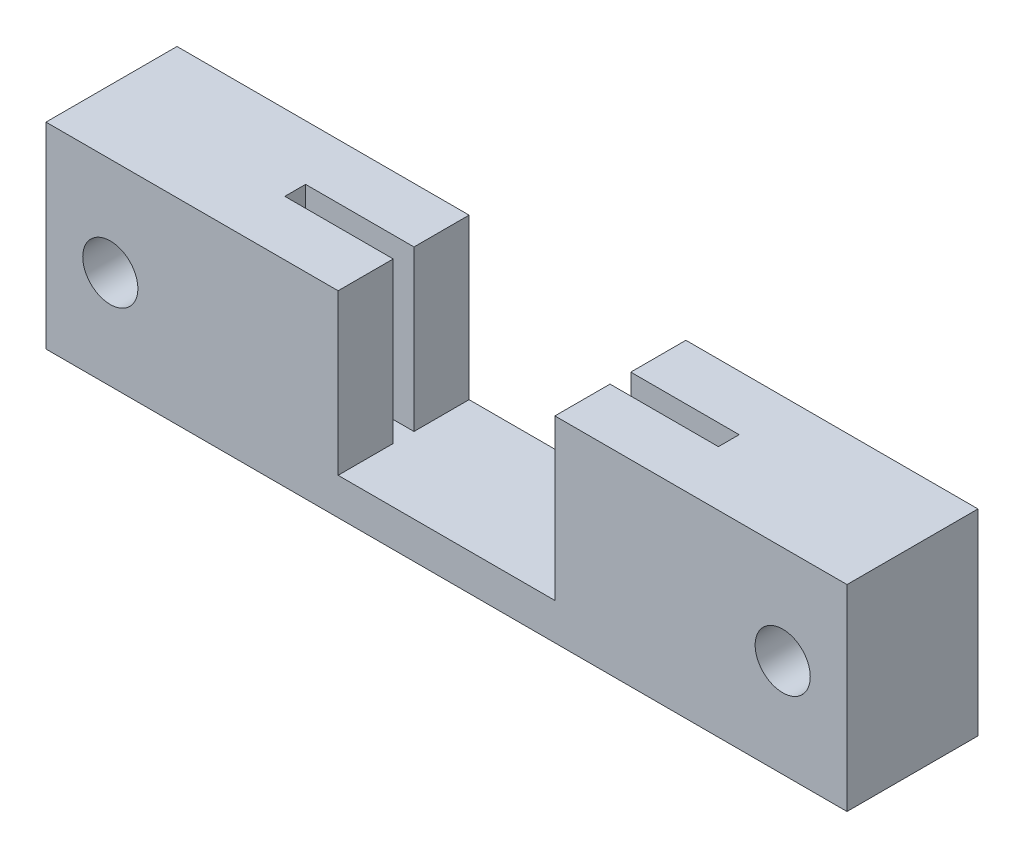
ISO-10303-21;
HEADER;
FILE_DESCRIPTION(('STEP AP214'),'2;1');
FILE_NAME('part.step','',(''),(''),'','','');
FILE_SCHEMA(('AUTOMOTIVE_DESIGN { 1 0 10303 214 1 1 1 1 }'));
ENDSEC;
DATA;
#1=APPLICATION_CONTEXT('core data for automotive mechanical design processes');
#2=APPLICATION_PROTOCOL_DEFINITION('international standard','automotive_design',2000,#1);
#3=PRODUCT_CONTEXT('',#1,'mechanical');
#4=PRODUCT('Part','Part','',(#3));
#5=PRODUCT_RELATED_PRODUCT_CATEGORY('part','',(#4));
#6=PRODUCT_DEFINITION_FORMATION('','',#4);
#7=PRODUCT_DEFINITION_CONTEXT('part definition',#1,'design');
#8=PRODUCT_DEFINITION('design','',#6,#7);
#9=PRODUCT_DEFINITION_SHAPE('','',#8);
#10=(LENGTH_UNIT() NAMED_UNIT(*) SI_UNIT(.MILLI.,.METRE.));
#11=(NAMED_UNIT(*) PLANE_ANGLE_UNIT() SI_UNIT($,.RADIAN.));
#12=(NAMED_UNIT(*) SI_UNIT($,.STERADIAN.) SOLID_ANGLE_UNIT());
#13=UNCERTAINTY_MEASURE_WITH_UNIT(LENGTH_MEASURE(1.E-05),#10,'distance_accuracy_value','');
#14=(GEOMETRIC_REPRESENTATION_CONTEXT(3) GLOBAL_UNCERTAINTY_ASSIGNED_CONTEXT((#13)) GLOBAL_UNIT_ASSIGNED_CONTEXT((#10,
#11,#12)) REPRESENTATION_CONTEXT('',''));
#15=CARTESIAN_POINT('',(0.,0.,0.));
#16=DIRECTION('',(0.,0.,1.));
#17=DIRECTION('',(1.,0.,0.));
#18=AXIS2_PLACEMENT_3D('',#15,#16,#17);
#19=CARTESIAN_POINT('',(0.,0.,0.));
#20=DIRECTION('',(0.,-1.,0.));
#21=DIRECTION('',(0.,0.,-1.));
#22=AXIS2_PLACEMENT_3D('',#19,#20,#21);
#23=PLANE('',#22);
#24=DIRECTION('',(0.,0.,1.));
#25=VECTOR('',#24,1.);
#26=CARTESIAN_POINT('',(5.9,0.,0.));
#27=LINE('',#26,#25);
#28=CARTESIAN_POINT('',(5.9,0.,0.565));
#29=VERTEX_POINT('',#28);
#30=CARTESIAN_POINT('',(5.9,0.,3.565));
#31=VERTEX_POINT('',#30);
#32=EDGE_CURVE('E288',#29,#31,#27,.T.);
#33=ORIENTED_EDGE('',*,*,#32,.F.);
#34=DIRECTION('',(1.,0.,0.));
#35=VECTOR('',#34,1.);
#36=CARTESIAN_POINT('',(0.,0.,0.565));
#37=LINE('',#36,#35);
#38=CARTESIAN_POINT('',(11.8,0.,0.565));
#39=VERTEX_POINT('',#38);
#40=EDGE_CURVE('E260',#29,#39,#37,.T.);
#41=ORIENTED_EDGE('',*,*,#40,.T.);
#42=DIRECTION('',(0.,0.,1.));
#43=VECTOR('',#42,1.);
#44=CARTESIAN_POINT('',(11.8,0.,0.));
#45=LINE('',#44,#43);
#46=CARTESIAN_POINT('',(11.8,0.,-0.565));
#47=VERTEX_POINT('',#46);
#48=EDGE_CURVE('E267',#47,#39,#45,.T.);
#49=ORIENTED_EDGE('',*,*,#48,.F.);
#50=DIRECTION('',(1.,0.,0.));
#51=VECTOR('',#50,1.);
#52=CARTESIAN_POINT('',(0.,0.,-0.565));
#53=LINE('',#52,#51);
#54=CARTESIAN_POINT('',(5.9,0.,-0.565));
#55=VERTEX_POINT('',#54);
#56=EDGE_CURVE('E294',#55,#47,#53,.T.);
#57=ORIENTED_EDGE('',*,*,#56,.F.);
#58=DIRECTION('',(0.,0.,-1.));
#59=VECTOR('',#58,1.);
#60=CARTESIAN_POINT('',(5.9,0.,0.));
#61=LINE('',#60,#59);
#62=CARTESIAN_POINT('',(5.9,0.,-3.565));
#63=VERTEX_POINT('',#62);
#64=EDGE_CURVE('E291',#55,#63,#61,.T.);
#65=ORIENTED_EDGE('',*,*,#64,.T.);
#66=DIRECTION('',(1.,0.,0.));
#67=VECTOR('',#66,1.);
#68=CARTESIAN_POINT('',(-14.8,0.,-3.565));
#69=LINE('',#68,#67);
#70=CARTESIAN_POINT('',(-5.9,0.,-3.565));
#71=VERTEX_POINT('',#70);
#72=EDGE_CURVE('E316',#71,#63,#69,.T.);
#73=ORIENTED_EDGE('',*,*,#72,.F.);
#74=DIRECTION('',(0.,0.,1.));
#75=VECTOR('',#74,1.);
#76=CARTESIAN_POINT('',(-5.9,0.,0.));
#77=LINE('',#76,#75);
#78=CARTESIAN_POINT('',(-5.9,0.,-0.565));
#79=VERTEX_POINT('',#78);
#80=EDGE_CURVE('E124',#71,#79,#77,.T.);
#81=ORIENTED_EDGE('',*,*,#80,.T.);
#82=DIRECTION('',(-1.,0.,0.));
#83=VECTOR('',#82,1.);
#84=CARTESIAN_POINT('',(0.,0.,-0.565));
#85=LINE('',#84,#83);
#86=CARTESIAN_POINT('',(-11.8,0.,-0.565));
#87=VERTEX_POINT('',#86);
#88=EDGE_CURVE('E134',#79,#87,#85,.T.);
#89=ORIENTED_EDGE('',*,*,#88,.T.);
#90=DIRECTION('',(0.,0.,1.));
#91=VECTOR('',#90,1.);
#92=CARTESIAN_POINT('',(-11.8,0.,0.));
#93=LINE('',#92,#91);
#94=CARTESIAN_POINT('',(-11.8,0.,0.565));
#95=VERTEX_POINT('',#94);
#96=EDGE_CURVE('E132',#87,#95,#93,.T.);
#97=ORIENTED_EDGE('',*,*,#96,.T.);
#98=DIRECTION('',(-1.,0.,0.));
#99=VECTOR('',#98,1.);
#100=CARTESIAN_POINT('',(0.,0.,0.565));
#101=LINE('',#100,#99);
#102=CARTESIAN_POINT('',(-5.9,0.,0.565));
#103=VERTEX_POINT('',#102);
#104=EDGE_CURVE('E113',#103,#95,#101,.T.);
#105=ORIENTED_EDGE('',*,*,#104,.F.);
#106=DIRECTION('',(0.,0.,1.));
#107=VECTOR('',#106,1.);
#108=CARTESIAN_POINT('',(-5.9,0.,0.));
#109=LINE('',#108,#107);
#110=CARTESIAN_POINT('',(-5.9,0.,3.565));
#111=VERTEX_POINT('',#110);
#112=EDGE_CURVE('E127',#103,#111,#109,.T.);
#113=ORIENTED_EDGE('',*,*,#112,.T.);
#114=DIRECTION('',(-1.,0.,0.));
#115=VECTOR('',#114,1.);
#116=CARTESIAN_POINT('',(-14.8,0.,3.565));
#117=LINE('',#116,#115);
#118=EDGE_CURVE('E152',#31,#111,#117,.T.);
#119=ORIENTED_EDGE('',*,*,#118,.F.);
#120=EDGE_LOOP('',(#33,#41,#49,#57,#65,#73,#81,#89,#97,#105,#113,#119));
#121=FACE_BOUND('',#120,.T.);
#122=ADVANCED_FACE('F42',(#121),#23,.F.);
#123=CARTESIAN_POINT('',(-5.9,8.7,0.));
#124=DIRECTION('',(1.,0.,0.));
#125=DIRECTION('',(0.,0.,-1.));
#126=AXIS2_PLACEMENT_3D('',#123,#124,#125);
#127=PLANE('',#126);
#128=ORIENTED_EDGE('',*,*,#80,.F.);
#129=DIRECTION('',(0.,-1.,0.));
#130=VECTOR('',#129,1.);
#131=CARTESIAN_POINT('',(-5.9,8.7,-3.565));
#132=LINE('',#131,#130);
#133=CARTESIAN_POINT('',(-5.9,8.7,-3.565));
#134=VERTEX_POINT('',#133);
#135=EDGE_CURVE('E11',#134,#71,#132,.T.);
#136=ORIENTED_EDGE('',*,*,#135,.F.);
#137=DIRECTION('',(0.,0.,1.));
#138=VECTOR('',#137,1.);
#139=CARTESIAN_POINT('',(-5.9,8.7,0.));
#140=LINE('',#139,#138);
#141=CARTESIAN_POINT('',(-5.9,8.7,-0.565));
#142=VERTEX_POINT('',#141);
#143=EDGE_CURVE('E137',#134,#142,#140,.T.);
#144=ORIENTED_EDGE('',*,*,#143,.T.);
#145=DIRECTION('',(0.,-1.,0.));
#146=VECTOR('',#145,1.);
#147=CARTESIAN_POINT('',(-5.9,8.7,-0.565));
#148=LINE('',#147,#146);
#149=EDGE_CURVE('E59',#142,#79,#148,.T.);
#150=ORIENTED_EDGE('',*,*,#149,.T.);
#151=EDGE_LOOP('',(#128,#136,#144,#150));
#152=FACE_BOUND('',#151,.T.);
#153=ADVANCED_FACE('F44',(#152),#127,.T.);
#154=CARTESIAN_POINT('',(0.,8.7,-3.565));
#155=DIRECTION('',(0.,0.,1.));
#156=DIRECTION('',(1.,0.,0.));
#157=AXIS2_PLACEMENT_3D('',#154,#155,#156);
#158=PLANE('',#157);
#159=ORIENTED_EDGE('',*,*,#135,.T.);
#160=ORIENTED_EDGE('',*,*,#72,.T.);
#161=DIRECTION('',(0.,-1.,0.));
#162=VECTOR('',#161,1.);
#163=CARTESIAN_POINT('',(5.9,8.7,-3.565));
#164=LINE('',#163,#162);
#165=CARTESIAN_POINT('',(5.9,8.7,-3.565));
#166=VERTEX_POINT('',#165);
#167=EDGE_CURVE('E307',#166,#63,#164,.T.);
#168=ORIENTED_EDGE('',*,*,#167,.F.);
#169=DIRECTION('',(1.,0.,0.));
#170=VECTOR('',#169,1.);
#171=CARTESIAN_POINT('',(0.,8.7,-3.565));
#172=LINE('',#171,#170);
#173=CARTESIAN_POINT('',(21.8,8.7,-3.565));
#174=VERTEX_POINT('',#173);
#175=EDGE_CURVE('E273',#166,#174,#172,.T.);
#176=ORIENTED_EDGE('',*,*,#175,.T.);
#177=DIRECTION('',(0.,1.,0.));
#178=VECTOR('',#177,1.);
#179=CARTESIAN_POINT('',(21.8,8.7,-3.565));
#180=LINE('',#179,#178);
#181=CARTESIAN_POINT('',(21.8,-2.,-3.565));
#182=VERTEX_POINT('',#181);
#183=EDGE_CURVE('E251',#182,#174,#180,.T.);
#184=ORIENTED_EDGE('',*,*,#183,.F.);
#185=DIRECTION('',(1.,0.,0.));
#186=VECTOR('',#185,1.);
#187=CARTESIAN_POINT('',(-14.8,-2.,-3.565));
#188=LINE('',#187,#186);
#189=CARTESIAN_POINT('',(-21.8,-2.,-3.565));
#190=VERTEX_POINT('',#189);
#191=EDGE_CURVE('E317',#190,#182,#188,.T.);
#192=ORIENTED_EDGE('',*,*,#191,.F.);
#193=DIRECTION('',(0.,-1.,0.));
#194=VECTOR('',#193,1.);
#195=CARTESIAN_POINT('',(-21.8,8.7,-3.565));
#196=LINE('',#195,#194);
#197=CARTESIAN_POINT('',(-21.8,8.7,-3.565));
#198=VERTEX_POINT('',#197);
#199=EDGE_CURVE('E233',#198,#190,#196,.T.);
#200=ORIENTED_EDGE('',*,*,#199,.F.);
#201=DIRECTION('',(-1.,0.,0.));
#202=VECTOR('',#201,1.);
#203=CARTESIAN_POINT('',(0.,8.7,-3.565));
#204=LINE('',#203,#202);
#205=EDGE_CURVE('E326',#134,#198,#204,.T.);
#206=ORIENTED_EDGE('',*,*,#205,.F.);
#207=EDGE_LOOP('',(#159,#160,#168,#176,#184,#192,#200,#206));
#208=FACE_BOUND('',#207,.T.);
#209=CARTESIAN_POINT('',(18.3,3.35,-3.565));
#210=DIRECTION('',(0.,0.,1.));
#211=DIRECTION('',(1.,0.,0.));
#212=AXIS2_PLACEMENT_3D('',#209,#210,#211);
#213=CIRCLE('',#212,1.5);
#214=CARTESIAN_POINT('',(19.8,3.35,-3.565));
#215=VERTEX_POINT('',#214);
#216=EDGE_CURVE('E245',#215,#215,#213,.T.);
#217=ORIENTED_EDGE('',*,*,#216,.T.);
#218=EDGE_LOOP('',(#217));
#219=FACE_BOUND('',#218,.T.);
#220=CARTESIAN_POINT('',(-18.3,3.35,-3.565));
#221=DIRECTION('',(0.,0.,1.));
#222=DIRECTION('',(-1.,0.,0.));
#223=AXIS2_PLACEMENT_3D('',#220,#221,#222);
#224=CIRCLE('',#223,1.5);
#225=CARTESIAN_POINT('',(-19.8,3.35,-3.565));
#226=VERTEX_POINT('',#225);
#227=EDGE_CURVE('E232',#226,#226,#224,.T.);
#228=ORIENTED_EDGE('',*,*,#227,.T.);
#229=EDGE_LOOP('',(#228));
#230=FACE_BOUND('',#229,.T.);
#231=ADVANCED_FACE('F169',(#208,#219,#230),#158,.F.);
#232=CARTESIAN_POINT('',(0.,8.7,3.565));
#233=DIRECTION('',(0.,0.,1.));
#234=DIRECTION('',(1.,0.,0.));
#235=AXIS2_PLACEMENT_3D('',#232,#233,#234);
#236=PLANE('',#235);
#237=DIRECTION('',(-1.,0.,0.));
#238=VECTOR('',#237,1.);
#239=CARTESIAN_POINT('',(0.,8.7,3.565));
#240=LINE('',#239,#238);
#241=CARTESIAN_POINT('',(-5.9,8.7,3.565));
#242=VERTEX_POINT('',#241);
#243=CARTESIAN_POINT('',(-21.8,8.7,3.565));
#244=VERTEX_POINT('',#243);
#245=EDGE_CURVE('E329',#242,#244,#240,.T.);
#246=ORIENTED_EDGE('',*,*,#245,.T.);
#247=DIRECTION('',(0.,-1.,0.));
#248=VECTOR('',#247,1.);
#249=CARTESIAN_POINT('',(-21.8,8.7,3.565));
#250=LINE('',#249,#248);
#251=CARTESIAN_POINT('',(-21.8,-2.,3.565));
#252=VERTEX_POINT('',#251);
#253=EDGE_CURVE('E220',#244,#252,#250,.T.);
#254=ORIENTED_EDGE('',*,*,#253,.T.);
#255=DIRECTION('',(-1.,0.,0.));
#256=VECTOR('',#255,1.);
#257=CARTESIAN_POINT('',(-14.8,-2.,3.565));
#258=LINE('',#257,#256);
#259=CARTESIAN_POINT('',(21.8,-2.,3.565));
#260=VERTEX_POINT('',#259);
#261=EDGE_CURVE('E128',#260,#252,#258,.T.);
#262=ORIENTED_EDGE('',*,*,#261,.F.);
#263=DIRECTION('',(0.,1.,0.));
#264=VECTOR('',#263,1.);
#265=CARTESIAN_POINT('',(21.8,8.7,3.565));
#266=LINE('',#265,#264);
#267=CARTESIAN_POINT('',(21.8,8.7,3.565));
#268=VERTEX_POINT('',#267);
#269=EDGE_CURVE('E248',#260,#268,#266,.T.);
#270=ORIENTED_EDGE('',*,*,#269,.T.);
#271=DIRECTION('',(1.,0.,0.));
#272=VECTOR('',#271,1.);
#273=CARTESIAN_POINT('',(0.,8.7,3.565));
#274=LINE('',#273,#272);
#275=CARTESIAN_POINT('',(5.9,8.7,3.565));
#276=VERTEX_POINT('',#275);
#277=EDGE_CURVE('E270',#276,#268,#274,.T.);
#278=ORIENTED_EDGE('',*,*,#277,.F.);
#279=DIRECTION('',(0.,-1.,0.));
#280=VECTOR('',#279,1.);
#281=CARTESIAN_POINT('',(5.9,8.7,3.565));
#282=LINE('',#281,#280);
#283=EDGE_CURVE('E310',#276,#31,#282,.T.);
#284=ORIENTED_EDGE('',*,*,#283,.T.);
#285=ORIENTED_EDGE('',*,*,#118,.T.);
#286=DIRECTION('',(0.,-1.,0.));
#287=VECTOR('',#286,1.);
#288=CARTESIAN_POINT('',(-5.9,8.7,3.565));
#289=LINE('',#288,#287);
#290=EDGE_CURVE('E51',#242,#111,#289,.T.);
#291=ORIENTED_EDGE('',*,*,#290,.F.);
#292=EDGE_LOOP('',(#246,#254,#262,#270,#278,#284,#285,#291));
#293=FACE_BOUND('',#292,.T.);
#294=CARTESIAN_POINT('',(18.3,3.35,3.565));
#295=DIRECTION('',(0.,0.,1.));
#296=DIRECTION('',(1.,0.,0.));
#297=AXIS2_PLACEMENT_3D('',#294,#295,#296);
#298=CIRCLE('',#297,1.5);
#299=CARTESIAN_POINT('',(19.8,3.35,3.565));
#300=VERTEX_POINT('',#299);
#301=EDGE_CURVE('E243',#300,#300,#298,.T.);
#302=ORIENTED_EDGE('',*,*,#301,.F.);
#303=EDGE_LOOP('',(#302));
#304=FACE_BOUND('',#303,.T.);
#305=CARTESIAN_POINT('',(-18.3,3.35,3.565));
#306=DIRECTION('',(0.,0.,1.));
#307=DIRECTION('',(-1.,0.,0.));
#308=AXIS2_PLACEMENT_3D('',#305,#306,#307);
#309=CIRCLE('',#308,1.5);
#310=CARTESIAN_POINT('',(-19.8,3.35,3.565));
#311=VERTEX_POINT('',#310);
#312=EDGE_CURVE('E236',#311,#311,#309,.T.);
#313=ORIENTED_EDGE('',*,*,#312,.F.);
#314=EDGE_LOOP('',(#313));
#315=FACE_BOUND('',#314,.T.);
#316=ADVANCED_FACE('F330',(#293,#304,#315),#236,.T.);
#317=CARTESIAN_POINT('',(-5.9,8.7,0.));
#318=DIRECTION('',(1.,0.,0.));
#319=DIRECTION('',(0.,0.,-1.));
#320=AXIS2_PLACEMENT_3D('',#317,#318,#319);
#321=PLANE('',#320);
#322=ORIENTED_EDGE('',*,*,#112,.F.);
#323=DIRECTION('',(0.,-1.,0.));
#324=VECTOR('',#323,1.);
#325=CARTESIAN_POINT('',(-5.9,8.7,0.565));
#326=LINE('',#325,#324);
#327=CARTESIAN_POINT('',(-5.9,8.7,0.565));
#328=VERTEX_POINT('',#327);
#329=EDGE_CURVE('E116',#328,#103,#326,.T.);
#330=ORIENTED_EDGE('',*,*,#329,.F.);
#331=DIRECTION('',(0.,0.,1.));
#332=VECTOR('',#331,1.);
#333=CARTESIAN_POINT('',(-5.9,8.7,0.));
#334=LINE('',#333,#332);
#335=EDGE_CURVE('E106',#328,#242,#334,.T.);
#336=ORIENTED_EDGE('',*,*,#335,.T.);
#337=ORIENTED_EDGE('',*,*,#290,.T.);
#338=EDGE_LOOP('',(#322,#330,#336,#337));
#339=FACE_BOUND('',#338,.T.);
#340=ADVANCED_FACE('F143',(#339),#321,.T.);
#341=CARTESIAN_POINT('',(0.,8.7,0.565));
#342=DIRECTION('',(0.,0.,1.));
#343=DIRECTION('',(1.,0.,0.));
#344=AXIS2_PLACEMENT_3D('',#341,#342,#343);
#345=PLANE('',#344);
#346=ORIENTED_EDGE('',*,*,#104,.T.);
#347=DIRECTION('',(0.,-1.,0.));
#348=VECTOR('',#347,1.);
#349=CARTESIAN_POINT('',(-11.8,8.7,0.565));
#350=LINE('',#349,#348);
#351=CARTESIAN_POINT('',(-11.8,8.7,0.565));
#352=VERTEX_POINT('',#351);
#353=EDGE_CURVE('E110',#352,#95,#350,.T.);
#354=ORIENTED_EDGE('',*,*,#353,.F.);
#355=DIRECTION('',(-1.,0.,0.));
#356=VECTOR('',#355,1.);
#357=CARTESIAN_POINT('',(0.,8.7,0.565));
#358=LINE('',#357,#356);
#359=EDGE_CURVE('E97',#328,#352,#358,.T.);
#360=ORIENTED_EDGE('',*,*,#359,.F.);
#361=ORIENTED_EDGE('',*,*,#329,.T.);
#362=EDGE_LOOP('',(#346,#354,#360,#361));
#363=FACE_BOUND('',#362,.T.);
#364=ADVANCED_FACE('F111',(#363),#345,.F.);
#365=CARTESIAN_POINT('',(-11.8,8.7,0.));
#366=DIRECTION('',(1.,0.,0.));
#367=DIRECTION('',(0.,0.,-1.));
#368=AXIS2_PLACEMENT_3D('',#365,#366,#367);
#369=PLANE('',#368);
#370=ORIENTED_EDGE('',*,*,#96,.F.);
#371=DIRECTION('',(0.,-1.,0.));
#372=VECTOR('',#371,1.);
#373=CARTESIAN_POINT('',(-11.8,8.7,-0.565));
#374=LINE('',#373,#372);
#375=CARTESIAN_POINT('',(-11.8,8.7,-0.565));
#376=VERTEX_POINT('',#375);
#377=EDGE_CURVE('E76',#376,#87,#374,.T.);
#378=ORIENTED_EDGE('',*,*,#377,.F.);
#379=DIRECTION('',(0.,0.,1.));
#380=VECTOR('',#379,1.);
#381=CARTESIAN_POINT('',(-11.8,8.7,0.));
#382=LINE('',#381,#380);
#383=EDGE_CURVE('E103',#376,#352,#382,.T.);
#384=ORIENTED_EDGE('',*,*,#383,.T.);
#385=ORIENTED_EDGE('',*,*,#353,.T.);
#386=EDGE_LOOP('',(#370,#378,#384,#385));
#387=FACE_BOUND('',#386,.T.);
#388=ADVANCED_FACE('F118',(#387),#369,.T.);
#389=CARTESIAN_POINT('',(0.,8.7,-0.565));
#390=DIRECTION('',(0.,0.,1.));
#391=DIRECTION('',(1.,0.,0.));
#392=AXIS2_PLACEMENT_3D('',#389,#390,#391);
#393=PLANE('',#392);
#394=ORIENTED_EDGE('',*,*,#88,.F.);
#395=ORIENTED_EDGE('',*,*,#149,.F.);
#396=DIRECTION('',(-1.,0.,0.));
#397=VECTOR('',#396,1.);
#398=CARTESIAN_POINT('',(0.,8.7,-0.565));
#399=LINE('',#398,#397);
#400=EDGE_CURVE('E119',#142,#376,#399,.T.);
#401=ORIENTED_EDGE('',*,*,#400,.T.);
#402=ORIENTED_EDGE('',*,*,#377,.T.);
#403=EDGE_LOOP('',(#394,#395,#401,#402));
#404=FACE_BOUND('',#403,.T.);
#405=ADVANCED_FACE('F154',(#404),#393,.T.);
#406=CARTESIAN_POINT('',(0.,8.7,0.));
#407=DIRECTION('',(0.,1.,0.));
#408=DIRECTION('',(0.,0.,1.));
#409=AXIS2_PLACEMENT_3D('',#406,#407,#408);
#410=PLANE('',#409);
#411=ORIENTED_EDGE('',*,*,#143,.F.);
#412=ORIENTED_EDGE('',*,*,#205,.T.);
#413=DIRECTION('',(0.,0.,1.));
#414=VECTOR('',#413,1.);
#415=CARTESIAN_POINT('',(-21.8,8.7,-3.565));
#416=LINE('',#415,#414);
#417=EDGE_CURVE('E224',#198,#244,#416,.T.);
#418=ORIENTED_EDGE('',*,*,#417,.T.);
#419=ORIENTED_EDGE('',*,*,#245,.F.);
#420=ORIENTED_EDGE('',*,*,#335,.F.);
#421=ORIENTED_EDGE('',*,*,#359,.T.);
#422=ORIENTED_EDGE('',*,*,#383,.F.);
#423=ORIENTED_EDGE('',*,*,#400,.F.);
#424=EDGE_LOOP('',(#411,#412,#418,#419,#420,#421,#422,#423));
#425=FACE_BOUND('',#424,.T.);
#426=ADVANCED_FACE('F100',(#425),#410,.T.);
#427=CARTESIAN_POINT('',(0.,-2.,0.));
#428=DIRECTION('',(0.,-1.,0.));
#429=DIRECTION('',(0.,0.,-1.));
#430=AXIS2_PLACEMENT_3D('',#427,#428,#429);
#431=PLANE('',#430);
#432=ORIENTED_EDGE('',*,*,#261,.T.);
#433=DIRECTION('',(0.,0.,1.));
#434=VECTOR('',#433,1.);
#435=CARTESIAN_POINT('',(-21.8,-2.,-3.565));
#436=LINE('',#435,#434);
#437=EDGE_CURVE('E228',#190,#252,#436,.T.);
#438=ORIENTED_EDGE('',*,*,#437,.F.);
#439=ORIENTED_EDGE('',*,*,#191,.T.);
#440=DIRECTION('',(0.,0.,1.));
#441=VECTOR('',#440,1.);
#442=CARTESIAN_POINT('',(21.8,-2.,-3.565));
#443=LINE('',#442,#441);
#444=EDGE_CURVE('E254',#182,#260,#443,.T.);
#445=ORIENTED_EDGE('',*,*,#444,.T.);
#446=EDGE_LOOP('',(#432,#438,#439,#445));
#447=FACE_BOUND('',#446,.T.);
#448=ADVANCED_FACE('F161',(#447),#431,.T.);
#449=CARTESIAN_POINT('',(0.,8.7,0.565));
#450=DIRECTION('',(0.,0.,-1.));
#451=DIRECTION('',(-1.,0.,0.));
#452=AXIS2_PLACEMENT_3D('',#449,#450,#451);
#453=PLANE('',#452);
#454=ORIENTED_EDGE('',*,*,#40,.F.);
#455=DIRECTION('',(0.,-1.,0.));
#456=VECTOR('',#455,1.);
#457=CARTESIAN_POINT('',(5.9,8.7,0.565));
#458=LINE('',#457,#456);
#459=CARTESIAN_POINT('',(5.9,8.7,0.565));
#460=VERTEX_POINT('',#459);
#461=EDGE_CURVE('E313',#460,#29,#458,.T.);
#462=ORIENTED_EDGE('',*,*,#461,.F.);
#463=DIRECTION('',(1.,0.,0.));
#464=VECTOR('',#463,1.);
#465=CARTESIAN_POINT('',(0.,8.7,0.565));
#466=LINE('',#465,#464);
#467=CARTESIAN_POINT('',(11.8,8.7,0.565));
#468=VERTEX_POINT('',#467);
#469=EDGE_CURVE('E263',#460,#468,#466,.T.);
#470=ORIENTED_EDGE('',*,*,#469,.T.);
#471=DIRECTION('',(0.,-1.,0.));
#472=VECTOR('',#471,1.);
#473=CARTESIAN_POINT('',(11.8,8.7,0.565));
#474=LINE('',#473,#472);
#475=EDGE_CURVE('E285',#468,#39,#474,.T.);
#476=ORIENTED_EDGE('',*,*,#475,.T.);
#477=EDGE_LOOP('',(#454,#462,#470,#476));
#478=FACE_BOUND('',#477,.T.);
#479=ADVANCED_FACE('F173',(#478),#453,.T.);
#480=CARTESIAN_POINT('',(5.9,8.7,0.));
#481=DIRECTION('',(1.,0.,0.));
#482=DIRECTION('',(0.,0.,-1.));
#483=AXIS2_PLACEMENT_3D('',#480,#481,#482);
#484=PLANE('',#483);
#485=ORIENTED_EDGE('',*,*,#32,.T.);
#486=ORIENTED_EDGE('',*,*,#283,.F.);
#487=DIRECTION('',(0.,0.,1.));
#488=VECTOR('',#487,1.);
#489=CARTESIAN_POINT('',(5.9,8.7,0.));
#490=LINE('',#489,#488);
#491=EDGE_CURVE('E266',#460,#276,#490,.T.);
#492=ORIENTED_EDGE('',*,*,#491,.F.);
#493=ORIENTED_EDGE('',*,*,#461,.T.);
#494=EDGE_LOOP('',(#485,#486,#492,#493));
#495=FACE_BOUND('',#494,.T.);
#496=ADVANCED_FACE('F177',(#495),#484,.F.);
#497=CARTESIAN_POINT('',(5.9,8.7,0.));
#498=DIRECTION('',(-1.,0.,0.));
#499=DIRECTION('',(0.,0.,1.));
#500=AXIS2_PLACEMENT_3D('',#497,#498,#499);
#501=PLANE('',#500);
#502=ORIENTED_EDGE('',*,*,#64,.F.);
#503=DIRECTION('',(0.,-1.,0.));
#504=VECTOR('',#503,1.);
#505=CARTESIAN_POINT('',(5.9,8.7,-0.565));
#506=LINE('',#505,#504);
#507=CARTESIAN_POINT('',(5.9,8.7,-0.565));
#508=VERTEX_POINT('',#507);
#509=EDGE_CURVE('E304',#508,#55,#506,.T.);
#510=ORIENTED_EDGE('',*,*,#509,.F.);
#511=DIRECTION('',(0.,0.,-1.));
#512=VECTOR('',#511,1.);
#513=CARTESIAN_POINT('',(5.9,8.7,0.));
#514=LINE('',#513,#512);
#515=EDGE_CURVE('E276',#508,#166,#514,.T.);
#516=ORIENTED_EDGE('',*,*,#515,.T.);
#517=ORIENTED_EDGE('',*,*,#167,.T.);
#518=EDGE_LOOP('',(#502,#510,#516,#517));
#519=FACE_BOUND('',#518,.T.);
#520=ADVANCED_FACE('F181',(#519),#501,.T.);
#521=CARTESIAN_POINT('',(0.,8.7,-0.565));
#522=DIRECTION('',(0.,0.,-1.));
#523=DIRECTION('',(-1.,0.,0.));
#524=AXIS2_PLACEMENT_3D('',#521,#522,#523);
#525=PLANE('',#524);
#526=ORIENTED_EDGE('',*,*,#56,.T.);
#527=DIRECTION('',(0.,-1.,0.));
#528=VECTOR('',#527,1.);
#529=CARTESIAN_POINT('',(11.8,8.7,-0.565));
#530=LINE('',#529,#528);
#531=CARTESIAN_POINT('',(11.8,8.7,-0.565));
#532=VERTEX_POINT('',#531);
#533=EDGE_CURVE('E301',#532,#47,#530,.T.);
#534=ORIENTED_EDGE('',*,*,#533,.F.);
#535=DIRECTION('',(1.,0.,0.));
#536=VECTOR('',#535,1.);
#537=CARTESIAN_POINT('',(0.,8.7,-0.565));
#538=LINE('',#537,#536);
#539=EDGE_CURVE('E279',#508,#532,#538,.T.);
#540=ORIENTED_EDGE('',*,*,#539,.F.);
#541=ORIENTED_EDGE('',*,*,#509,.T.);
#542=EDGE_LOOP('',(#526,#534,#540,#541));
#543=FACE_BOUND('',#542,.T.);
#544=ADVANCED_FACE('F185',(#543),#525,.F.);
#545=CARTESIAN_POINT('',(11.8,8.7,0.));
#546=DIRECTION('',(1.,0.,0.));
#547=DIRECTION('',(0.,0.,-1.));
#548=AXIS2_PLACEMENT_3D('',#545,#546,#547);
#549=PLANE('',#548);
#550=ORIENTED_EDGE('',*,*,#48,.T.);
#551=ORIENTED_EDGE('',*,*,#475,.F.);
#552=DIRECTION('',(0.,0.,1.));
#553=VECTOR('',#552,1.);
#554=CARTESIAN_POINT('',(11.8,8.7,0.));
#555=LINE('',#554,#553);
#556=EDGE_CURVE('E282',#532,#468,#555,.T.);
#557=ORIENTED_EDGE('',*,*,#556,.F.);
#558=ORIENTED_EDGE('',*,*,#533,.T.);
#559=EDGE_LOOP('',(#550,#551,#557,#558));
#560=FACE_BOUND('',#559,.T.);
#561=ADVANCED_FACE('F189',(#560),#549,.F.);
#562=CARTESIAN_POINT('',(0.,8.7,0.));
#563=DIRECTION('',(0.,1.,0.));
#564=DIRECTION('',(0.,0.,1.));
#565=AXIS2_PLACEMENT_3D('',#562,#563,#564);
#566=PLANE('',#565);
#567=ORIENTED_EDGE('',*,*,#469,.F.);
#568=ORIENTED_EDGE('',*,*,#491,.T.);
#569=ORIENTED_EDGE('',*,*,#277,.T.);
#570=DIRECTION('',(0.,0.,1.));
#571=VECTOR('',#570,1.);
#572=CARTESIAN_POINT('',(21.8,8.7,-3.565));
#573=LINE('',#572,#571);
#574=EDGE_CURVE('E257',#174,#268,#573,.T.);
#575=ORIENTED_EDGE('',*,*,#574,.F.);
#576=ORIENTED_EDGE('',*,*,#175,.F.);
#577=ORIENTED_EDGE('',*,*,#515,.F.);
#578=ORIENTED_EDGE('',*,*,#539,.T.);
#579=ORIENTED_EDGE('',*,*,#556,.T.);
#580=EDGE_LOOP('',(#567,#568,#569,#575,#576,#577,#578,#579));
#581=FACE_BOUND('',#580,.T.);
#582=ADVANCED_FACE('F193',(#581),#566,.T.);
#583=CARTESIAN_POINT('',(21.8,8.7,-3.565));
#584=DIRECTION('',(1.,0.,0.));
#585=DIRECTION('',(0.,0.,-1.));
#586=AXIS2_PLACEMENT_3D('',#583,#584,#585);
#587=PLANE('',#586);
#588=ORIENTED_EDGE('',*,*,#269,.F.);
#589=ORIENTED_EDGE('',*,*,#444,.F.);
#590=ORIENTED_EDGE('',*,*,#183,.T.);
#591=ORIENTED_EDGE('',*,*,#574,.T.);
#592=EDGE_LOOP('',(#588,#589,#590,#591));
#593=FACE_BOUND('',#592,.T.);
#594=ADVANCED_FACE('F197',(#593),#587,.T.);
#595=CARTESIAN_POINT('',(18.3,3.35,-3.565));
#596=DIRECTION('',(0.,0.,1.));
#597=DIRECTION('',(1.,0.,0.));
#598=AXIS2_PLACEMENT_3D('',#595,#596,#597);
#599=CYLINDRICAL_SURFACE('',#598,1.5);
#600=ORIENTED_EDGE('',*,*,#216,.F.);
#601=EDGE_LOOP('',(#600));
#602=FACE_BOUND('',#601,.T.);
#603=ORIENTED_EDGE('',*,*,#301,.T.);
#604=EDGE_LOOP('',(#603));
#605=FACE_BOUND('',#604,.T.);
#606=ADVANCED_FACE('F201',(#602,#605),#599,.F.);
#607=CARTESIAN_POINT('',(-21.8,8.7,-3.565));
#608=DIRECTION('',(-1.,0.,0.));
#609=DIRECTION('',(0.,0.,1.));
#610=AXIS2_PLACEMENT_3D('',#607,#608,#609);
#611=PLANE('',#610);
#612=ORIENTED_EDGE('',*,*,#253,.F.);
#613=ORIENTED_EDGE('',*,*,#417,.F.);
#614=ORIENTED_EDGE('',*,*,#199,.T.);
#615=ORIENTED_EDGE('',*,*,#437,.T.);
#616=EDGE_LOOP('',(#612,#613,#614,#615));
#617=FACE_BOUND('',#616,.T.);
#618=ADVANCED_FACE('F205',(#617),#611,.T.);
#619=CARTESIAN_POINT('',(-18.3,3.35,-3.565));
#620=DIRECTION('',(0.,0.,1.));
#621=DIRECTION('',(1.,0.,0.));
#622=AXIS2_PLACEMENT_3D('',#619,#620,#621);
#623=CYLINDRICAL_SURFACE('',#622,1.5);
#624=ORIENTED_EDGE('',*,*,#227,.F.);
#625=EDGE_LOOP('',(#624));
#626=FACE_BOUND('',#625,.T.);
#627=ORIENTED_EDGE('',*,*,#312,.T.);
#628=EDGE_LOOP('',(#627));
#629=FACE_BOUND('',#628,.T.);
#630=ADVANCED_FACE('F207',(#626,#629),#623,.F.);
#631=CLOSED_SHELL('',(#122,#153,#231,#316,#340,#364,#388,#405,#426,#448,#479,#496,#520,#544,
#561,#582,#594,#606,#618,#630));
#632=MANIFOLD_SOLID_BREP('B2',#631);
#633=ADVANCED_BREP_SHAPE_REPRESENTATION('',(#18,#632),#14);
#634=SHAPE_DEFINITION_REPRESENTATION(#9,#633);
ENDSEC;
END-ISO-10303-21;
